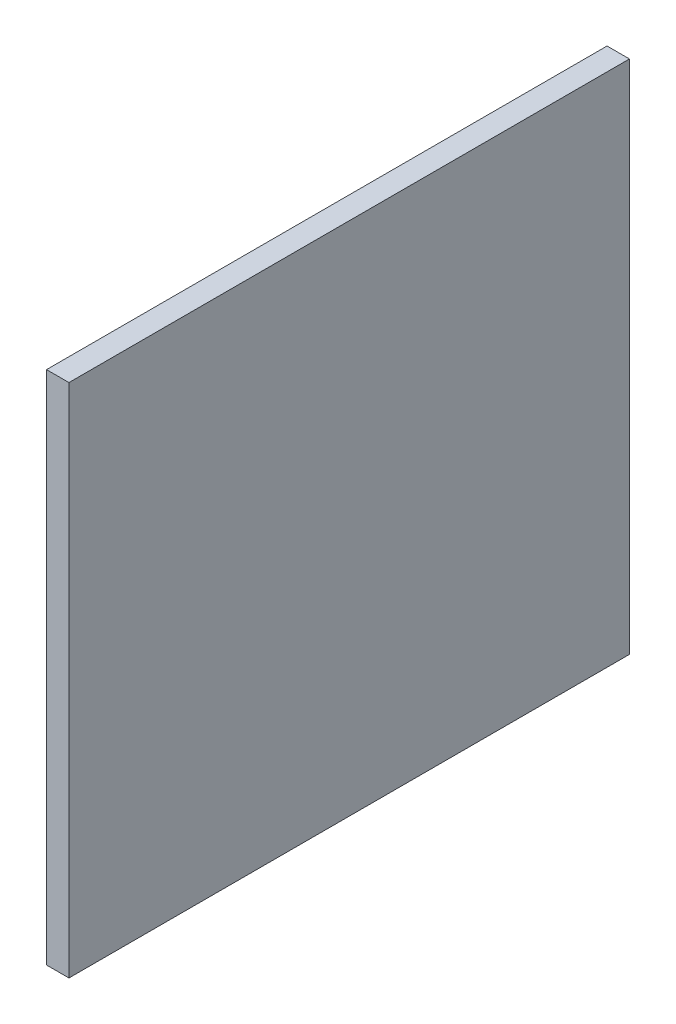
ISO-10303-21;
HEADER;
FILE_DESCRIPTION(('STEP AP214'),'2;1');
FILE_NAME('part.step','',(''),(''),'','','');
FILE_SCHEMA(('AUTOMOTIVE_DESIGN { 1 0 10303 214 1 1 1 1 }'));
ENDSEC;
DATA;
#1=APPLICATION_CONTEXT('core data for automotive mechanical design processes');
#2=APPLICATION_PROTOCOL_DEFINITION('international standard','automotive_design',2000,#1);
#3=PRODUCT_CONTEXT('',#1,'mechanical');
#4=PRODUCT('Part','Part','',(#3));
#5=PRODUCT_RELATED_PRODUCT_CATEGORY('part','',(#4));
#6=PRODUCT_DEFINITION_FORMATION('','',#4);
#7=PRODUCT_DEFINITION_CONTEXT('part definition',#1,'design');
#8=PRODUCT_DEFINITION('design','',#6,#7);
#9=PRODUCT_DEFINITION_SHAPE('','',#8);
#10=(LENGTH_UNIT() NAMED_UNIT(*) SI_UNIT(.MILLI.,.METRE.));
#11=(NAMED_UNIT(*) PLANE_ANGLE_UNIT() SI_UNIT($,.RADIAN.));
#12=(NAMED_UNIT(*) SI_UNIT($,.STERADIAN.) SOLID_ANGLE_UNIT());
#13=UNCERTAINTY_MEASURE_WITH_UNIT(LENGTH_MEASURE(1.E-05),#10,'distance_accuracy_value','');
#14=(GEOMETRIC_REPRESENTATION_CONTEXT(3) GLOBAL_UNCERTAINTY_ASSIGNED_CONTEXT((#13)) GLOBAL_UNIT_ASSIGNED_CONTEXT((#10,
#11,#12)) REPRESENTATION_CONTEXT('',''));
#15=CARTESIAN_POINT('',(0.,0.,0.));
#16=DIRECTION('',(0.,0.,1.));
#17=DIRECTION('',(1.,0.,0.));
#18=AXIS2_PLACEMENT_3D('',#15,#16,#17);
#19=CARTESIAN_POINT('',(-0.3175,7.3025,0.));
#20=DIRECTION('',(1.,0.,0.));
#21=DIRECTION('',(0.,0.,-1.));
#22=AXIS2_PLACEMENT_3D('',#19,#20,#21);
#23=PLANE('',#22);
#24=DIRECTION('',(0.,0.,1.));
#25=VECTOR('',#24,1.);
#26=CARTESIAN_POINT('',(-0.3175,-7.3025,0.));
#27=LINE('',#26,#25);
#28=CARTESIAN_POINT('',(-0.3175,-7.3025,0.));
#29=VERTEX_POINT('',#28);
#30=CARTESIAN_POINT('',(-0.3175,-7.3025,15.875));
#31=VERTEX_POINT('',#30);
#32=EDGE_CURVE('E19',#29,#31,#27,.T.);
#33=ORIENTED_EDGE('',*,*,#32,.T.);
#34=DIRECTION('',(0.,1.,0.));
#35=VECTOR('',#34,1.);
#36=CARTESIAN_POINT('',(-0.3175,-7.3025,15.875));
#37=LINE('',#36,#35);
#38=CARTESIAN_POINT('',(-0.3175,7.3025,15.875));
#39=VERTEX_POINT('',#38);
#40=EDGE_CURVE('E54',#31,#39,#37,.T.);
#41=ORIENTED_EDGE('',*,*,#40,.T.);
#42=DIRECTION('',(0.,0.,-1.));
#43=VECTOR('',#42,1.);
#44=CARTESIAN_POINT('',(-0.3175,7.3025,0.));
#45=LINE('',#44,#43);
#46=CARTESIAN_POINT('',(-0.3175,7.3025,0.));
#47=VERTEX_POINT('',#46);
#48=EDGE_CURVE('E73',#39,#47,#45,.T.);
#49=ORIENTED_EDGE('',*,*,#48,.T.);
#50=DIRECTION('',(0.,1.,0.));
#51=VECTOR('',#50,1.);
#52=CARTESIAN_POINT('',(-0.3175,-7.3025,0.));
#53=LINE('',#52,#51);
#54=EDGE_CURVE('E65',#29,#47,#53,.T.);
#55=ORIENTED_EDGE('',*,*,#54,.F.);
#56=EDGE_LOOP('',(#33,#41,#49,#55));
#57=FACE_BOUND('',#56,.T.);
#58=ADVANCED_FACE('F16',(#57),#23,.F.);
#59=CARTESIAN_POINT('',(-0.3175,-7.3025,0.));
#60=DIRECTION('',(0.,1.,0.));
#61=DIRECTION('',(0.,0.,1.));
#62=AXIS2_PLACEMENT_3D('',#59,#60,#61);
#63=PLANE('',#62);
#64=DIRECTION('',(0.,0.,1.));
#65=VECTOR('',#64,1.);
#66=CARTESIAN_POINT('',(0.3175,-7.3025,0.));
#67=LINE('',#66,#65);
#68=CARTESIAN_POINT('',(0.3175,-7.3025,0.));
#69=VERTEX_POINT('',#68);
#70=CARTESIAN_POINT('',(0.3175,-7.3025,15.875));
#71=VERTEX_POINT('',#70);
#72=EDGE_CURVE('E71',#69,#71,#67,.T.);
#73=ORIENTED_EDGE('',*,*,#72,.T.);
#74=DIRECTION('',(-1.,0.,0.));
#75=VECTOR('',#74,1.);
#76=CARTESIAN_POINT('',(-0.3175,-7.3025,15.875));
#77=LINE('',#76,#75);
#78=EDGE_CURVE('E61',#71,#31,#77,.T.);
#79=ORIENTED_EDGE('',*,*,#78,.T.);
#80=ORIENTED_EDGE('',*,*,#32,.F.);
#81=DIRECTION('',(-1.,0.,0.));
#82=VECTOR('',#81,1.);
#83=CARTESIAN_POINT('',(-0.3175,-7.3025,0.));
#84=LINE('',#83,#82);
#85=EDGE_CURVE('E79',#69,#29,#84,.T.);
#86=ORIENTED_EDGE('',*,*,#85,.F.);
#87=EDGE_LOOP('',(#73,#79,#80,#86));
#88=FACE_BOUND('',#87,.T.);
#89=ADVANCED_FACE('F70',(#88),#63,.F.);
#90=CARTESIAN_POINT('',(-0.3175,-7.3025,15.875));
#91=DIRECTION('',(0.,0.,-1.));
#92=DIRECTION('',(-1.,0.,0.));
#93=AXIS2_PLACEMENT_3D('',#90,#91,#92);
#94=PLANE('',#93);
#95=DIRECTION('',(0.,1.,0.));
#96=VECTOR('',#95,1.);
#97=CARTESIAN_POINT('',(0.3175,-7.3025,15.875));
#98=LINE('',#97,#96);
#99=CARTESIAN_POINT('',(0.3175,7.3025,15.875));
#100=VERTEX_POINT('',#99);
#101=EDGE_CURVE('E82',#71,#100,#98,.T.);
#102=ORIENTED_EDGE('',*,*,#101,.T.);
#103=DIRECTION('',(1.,0.,0.));
#104=VECTOR('',#103,1.);
#105=CARTESIAN_POINT('',(0.3175,7.3025,15.875));
#106=LINE('',#105,#104);
#107=EDGE_CURVE('E63',#100,#39,#106,.F.);
#108=ORIENTED_EDGE('',*,*,#107,.T.);
#109=ORIENTED_EDGE('',*,*,#40,.F.);
#110=ORIENTED_EDGE('',*,*,#78,.F.);
#111=EDGE_LOOP('',(#102,#108,#109,#110));
#112=FACE_BOUND('',#111,.T.);
#113=ADVANCED_FACE('F59',(#112),#94,.F.);
#114=CARTESIAN_POINT('',(0.3175,7.3025,0.));
#115=DIRECTION('',(0.,-1.,0.));
#116=DIRECTION('',(0.,0.,-1.));
#117=AXIS2_PLACEMENT_3D('',#114,#115,#116);
#118=PLANE('',#117);
#119=ORIENTED_EDGE('',*,*,#48,.F.);
#120=ORIENTED_EDGE('',*,*,#107,.F.);
#121=DIRECTION('',(0.,0.,1.));
#122=VECTOR('',#121,1.);
#123=CARTESIAN_POINT('',(0.3175,7.3025,0.));
#124=LINE('',#123,#122);
#125=CARTESIAN_POINT('',(0.3175,7.3025,0.));
#126=VERTEX_POINT('',#125);
#127=EDGE_CURVE('E25',#100,#126,#124,.F.);
#128=ORIENTED_EDGE('',*,*,#127,.T.);
#129=DIRECTION('',(-1.,0.,0.));
#130=VECTOR('',#129,1.);
#131=CARTESIAN_POINT('',(-0.3175,7.3025,0.));
#132=LINE('',#131,#130);
#133=EDGE_CURVE('E33',#47,#126,#132,.F.);
#134=ORIENTED_EDGE('',*,*,#133,.F.);
#135=EDGE_LOOP('',(#119,#120,#128,#134));
#136=FACE_BOUND('',#135,.T.);
#137=ADVANCED_FACE('F87',(#136),#118,.F.);
#138=CARTESIAN_POINT('',(-0.3175,-7.3025,0.));
#139=DIRECTION('',(0.,0.,-1.));
#140=DIRECTION('',(-1.,0.,0.));
#141=AXIS2_PLACEMENT_3D('',#138,#139,#140);
#142=PLANE('',#141);
#143=DIRECTION('',(0.,1.,0.));
#144=VECTOR('',#143,1.);
#145=CARTESIAN_POINT('',(0.3175,-7.3025,0.));
#146=LINE('',#145,#144);
#147=EDGE_CURVE('E10',#126,#69,#146,.F.);
#148=ORIENTED_EDGE('',*,*,#147,.T.);
#149=ORIENTED_EDGE('',*,*,#85,.T.);
#150=ORIENTED_EDGE('',*,*,#54,.T.);
#151=ORIENTED_EDGE('',*,*,#133,.T.);
#152=EDGE_LOOP('',(#148,#149,#150,#151));
#153=FACE_BOUND('',#152,.T.);
#154=ADVANCED_FACE('F90',(#153),#142,.T.);
#155=CARTESIAN_POINT('',(0.3175,-7.3025,0.));
#156=DIRECTION('',(-1.,0.,0.));
#157=DIRECTION('',(0.,0.,1.));
#158=AXIS2_PLACEMENT_3D('',#155,#156,#157);
#159=PLANE('',#158);
#160=ORIENTED_EDGE('',*,*,#127,.F.);
#161=ORIENTED_EDGE('',*,*,#101,.F.);
#162=ORIENTED_EDGE('',*,*,#72,.F.);
#163=ORIENTED_EDGE('',*,*,#147,.F.);
#164=EDGE_LOOP('',(#160,#161,#162,#163));
#165=FACE_BOUND('',#164,.T.);
#166=ADVANCED_FACE('F89',(#165),#159,.F.);
#167=CLOSED_SHELL('',(#58,#89,#113,#137,#154,#166));
#168=MANIFOLD_SOLID_BREP('B1',#167);
#169=ADVANCED_BREP_SHAPE_REPRESENTATION('',(#18,#168),#14);
#170=SHAPE_DEFINITION_REPRESENTATION(#9,#169);
ENDSEC;
END-ISO-10303-21;
